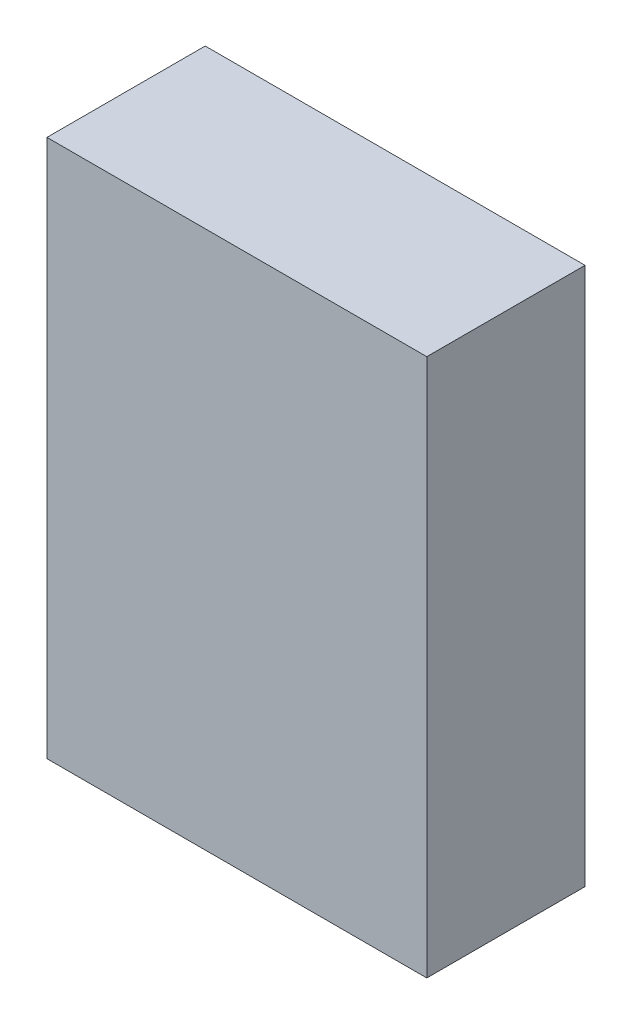
ISO-10303-21;
HEADER;
FILE_DESCRIPTION(('STEP AP214'),'2;1');
FILE_NAME('part.step','',(''),(''),'','','');
FILE_SCHEMA(('AUTOMOTIVE_DESIGN { 1 0 10303 214 1 1 1 1 }'));
ENDSEC;
DATA;
#1=APPLICATION_CONTEXT('core data for automotive mechanical design processes');
#2=APPLICATION_PROTOCOL_DEFINITION('international standard','automotive_design',2000,#1);
#3=PRODUCT_CONTEXT('',#1,'mechanical');
#4=PRODUCT('Part','Part','',(#3));
#5=PRODUCT_RELATED_PRODUCT_CATEGORY('part','',(#4));
#6=PRODUCT_DEFINITION_FORMATION('','',#4);
#7=PRODUCT_DEFINITION_CONTEXT('part definition',#1,'design');
#8=PRODUCT_DEFINITION('design','',#6,#7);
#9=PRODUCT_DEFINITION_SHAPE('','',#8);
#10=(LENGTH_UNIT() NAMED_UNIT(*) SI_UNIT(.MILLI.,.METRE.));
#11=(NAMED_UNIT(*) PLANE_ANGLE_UNIT() SI_UNIT($,.RADIAN.));
#12=(NAMED_UNIT(*) SI_UNIT($,.STERADIAN.) SOLID_ANGLE_UNIT());
#13=UNCERTAINTY_MEASURE_WITH_UNIT(LENGTH_MEASURE(1.E-05),#10,'distance_accuracy_value','');
#14=(GEOMETRIC_REPRESENTATION_CONTEXT(3) GLOBAL_UNCERTAINTY_ASSIGNED_CONTEXT((#13)) GLOBAL_UNIT_ASSIGNED_CONTEXT((#10,
#11,#12)) REPRESENTATION_CONTEXT('',''));
#15=CARTESIAN_POINT('',(0.,0.,0.));
#16=DIRECTION('',(0.,0.,1.));
#17=DIRECTION('',(1.,0.,0.));
#18=AXIS2_PLACEMENT_3D('',#15,#16,#17);
#19=CARTESIAN_POINT('',(1.63,2.58,0.));
#20=DIRECTION('',(1.,0.,0.));
#21=DIRECTION('',(0.,0.,1.));
#22=AXIS2_PLACEMENT_3D('',#19,#20,#21);
#23=PLANE('',#22);
#24=DIRECTION('',(0.,1.,0.));
#25=VECTOR('',#24,1.);
#26=CARTESIAN_POINT('',(1.63,2.58,0.1));
#27=LINE('',#26,#25);
#28=CARTESIAN_POINT('',(1.63,2.58,0.1));
#29=VERTEX_POINT('',#28);
#30=CARTESIAN_POINT('',(1.63,2.92,0.1));
#31=VERTEX_POINT('',#30);
#32=EDGE_CURVE('E11',#29,#31,#27,.T.);
#33=ORIENTED_EDGE('',*,*,#32,.T.);
#34=DIRECTION('',(0.,0.,1.));
#35=VECTOR('',#34,1.);
#36=CARTESIAN_POINT('',(1.63,2.92,0.));
#37=LINE('',#36,#35);
#38=CARTESIAN_POINT('',(1.63,2.92,0.));
#39=VERTEX_POINT('',#38);
#40=EDGE_CURVE('E24',#39,#31,#37,.T.);
#41=ORIENTED_EDGE('',*,*,#40,.F.);
#42=DIRECTION('',(0.,1.,0.));
#43=VECTOR('',#42,1.);
#44=CARTESIAN_POINT('',(1.63,2.58,0.));
#45=LINE('',#44,#43);
#46=CARTESIAN_POINT('',(1.63,2.58,0.));
#47=VERTEX_POINT('',#46);
#48=EDGE_CURVE('E86',#47,#39,#45,.T.);
#49=ORIENTED_EDGE('',*,*,#48,.F.);
#50=DIRECTION('',(0.,0.,1.));
#51=VECTOR('',#50,1.);
#52=CARTESIAN_POINT('',(1.63,2.58,0.));
#53=LINE('',#52,#51);
#54=EDGE_CURVE('E36',#47,#29,#53,.T.);
#55=ORIENTED_EDGE('',*,*,#54,.T.);
#56=EDGE_LOOP('',(#33,#41,#49,#55));
#57=FACE_BOUND('',#56,.T.);
#58=ADVANCED_FACE('F17',(#57),#23,.F.);
#59=CARTESIAN_POINT('',(1.87,2.58,0.));
#60=DIRECTION('',(1.,0.,0.));
#61=DIRECTION('',(0.,0.,1.));
#62=AXIS2_PLACEMENT_3D('',#59,#60,#61);
#63=PLANE('',#62);
#64=DIRECTION('',(0.,0.,1.));
#65=VECTOR('',#64,1.);
#66=CARTESIAN_POINT('',(1.87,2.58,0.));
#67=LINE('',#66,#65);
#68=CARTESIAN_POINT('',(1.87,2.58,0.));
#69=VERTEX_POINT('',#68);
#70=CARTESIAN_POINT('',(1.87,2.58,0.1));
#71=VERTEX_POINT('',#70);
#72=EDGE_CURVE('E83',#69,#71,#67,.T.);
#73=ORIENTED_EDGE('',*,*,#72,.F.);
#74=DIRECTION('',(0.,1.,0.));
#75=VECTOR('',#74,1.);
#76=CARTESIAN_POINT('',(1.87,2.58,0.));
#77=LINE('',#76,#75);
#78=CARTESIAN_POINT('',(1.87,2.92,0.));
#79=VERTEX_POINT('',#78);
#80=EDGE_CURVE('E63',#69,#79,#77,.T.);
#81=ORIENTED_EDGE('',*,*,#80,.T.);
#82=DIRECTION('',(0.,0.,1.));
#83=VECTOR('',#82,1.);
#84=CARTESIAN_POINT('',(1.87,2.92,0.));
#85=LINE('',#84,#83);
#86=CARTESIAN_POINT('',(1.87,2.92,0.1));
#87=VERTEX_POINT('',#86);
#88=EDGE_CURVE('E57',#79,#87,#85,.T.);
#89=ORIENTED_EDGE('',*,*,#88,.T.);
#90=DIRECTION('',(0.,1.,0.));
#91=VECTOR('',#90,1.);
#92=CARTESIAN_POINT('',(1.87,2.58,0.1));
#93=LINE('',#92,#91);
#94=EDGE_CURVE('E60',#71,#87,#93,.T.);
#95=ORIENTED_EDGE('',*,*,#94,.F.);
#96=EDGE_LOOP('',(#73,#81,#89,#95));
#97=FACE_BOUND('',#96,.T.);
#98=ADVANCED_FACE('F59',(#97),#63,.T.);
#99=CARTESIAN_POINT('',(1.63,2.58,0.));
#100=DIRECTION('',(0.,1.,0.));
#101=DIRECTION('',(0.,0.,1.));
#102=AXIS2_PLACEMENT_3D('',#99,#100,#101);
#103=PLANE('',#102);
#104=ORIENTED_EDGE('',*,*,#72,.T.);
#105=DIRECTION('',(1.,0.,0.));
#106=VECTOR('',#105,1.);
#107=CARTESIAN_POINT('',(1.63,2.58,0.1));
#108=LINE('',#107,#106);
#109=EDGE_CURVE('E71',#29,#71,#108,.T.);
#110=ORIENTED_EDGE('',*,*,#109,.F.);
#111=ORIENTED_EDGE('',*,*,#54,.F.);
#112=DIRECTION('',(1.,0.,0.));
#113=VECTOR('',#112,1.);
#114=CARTESIAN_POINT('',(1.63,2.58,0.));
#115=LINE('',#114,#113);
#116=EDGE_CURVE('E76',#47,#69,#115,.T.);
#117=ORIENTED_EDGE('',*,*,#116,.T.);
#118=EDGE_LOOP('',(#104,#110,#111,#117));
#119=FACE_BOUND('',#118,.T.);
#120=ADVANCED_FACE('F91',(#119),#103,.F.);
#121=CARTESIAN_POINT('',(1.63,2.92,0.));
#122=DIRECTION('',(0.,1.,0.));
#123=DIRECTION('',(0.,0.,1.));
#124=AXIS2_PLACEMENT_3D('',#121,#122,#123);
#125=PLANE('',#124);
#126=DIRECTION('',(1.,0.,0.));
#127=VECTOR('',#126,1.);
#128=CARTESIAN_POINT('',(1.63,2.92,0.));
#129=LINE('',#128,#127);
#130=EDGE_CURVE('E74',#39,#79,#129,.T.);
#131=ORIENTED_EDGE('',*,*,#130,.F.);
#132=ORIENTED_EDGE('',*,*,#40,.T.);
#133=DIRECTION('',(1.,0.,0.));
#134=VECTOR('',#133,1.);
#135=CARTESIAN_POINT('',(1.63,2.92,0.1));
#136=LINE('',#135,#134);
#137=EDGE_CURVE('E69',#31,#87,#136,.T.);
#138=ORIENTED_EDGE('',*,*,#137,.T.);
#139=ORIENTED_EDGE('',*,*,#88,.F.);
#140=EDGE_LOOP('',(#131,#132,#138,#139));
#141=FACE_BOUND('',#140,.T.);
#142=ADVANCED_FACE('F73',(#141),#125,.T.);
#143=CARTESIAN_POINT('',(1.63,2.58,0.));
#144=DIRECTION('',(0.,0.,1.));
#145=DIRECTION('',(1.,0.,0.));
#146=AXIS2_PLACEMENT_3D('',#143,#144,#145);
#147=PLANE('',#146);
#148=ORIENTED_EDGE('',*,*,#130,.T.);
#149=ORIENTED_EDGE('',*,*,#80,.F.);
#150=ORIENTED_EDGE('',*,*,#116,.F.);
#151=ORIENTED_EDGE('',*,*,#48,.T.);
#152=EDGE_LOOP('',(#148,#149,#150,#151));
#153=FACE_BOUND('',#152,.T.);
#154=ADVANCED_FACE('F89',(#153),#147,.F.);
#155=CARTESIAN_POINT('',(1.63,2.58,0.1));
#156=DIRECTION('',(0.,0.,1.));
#157=DIRECTION('',(1.,0.,0.));
#158=AXIS2_PLACEMENT_3D('',#155,#156,#157);
#159=PLANE('',#158);
#160=ORIENTED_EDGE('',*,*,#32,.F.);
#161=ORIENTED_EDGE('',*,*,#109,.T.);
#162=ORIENTED_EDGE('',*,*,#94,.T.);
#163=ORIENTED_EDGE('',*,*,#137,.F.);
#164=EDGE_LOOP('',(#160,#161,#162,#163));
#165=FACE_BOUND('',#164,.T.);
#166=ADVANCED_FACE('F68',(#165),#159,.T.);
#167=CLOSED_SHELL('',(#58,#98,#120,#142,#154,#166));
#168=MANIFOLD_SOLID_BREP('B1',#167);
#169=ADVANCED_BREP_SHAPE_REPRESENTATION('',(#18,#168),#14);
#170=SHAPE_DEFINITION_REPRESENTATION(#9,#169);
ENDSEC;
END-ISO-10303-21;
